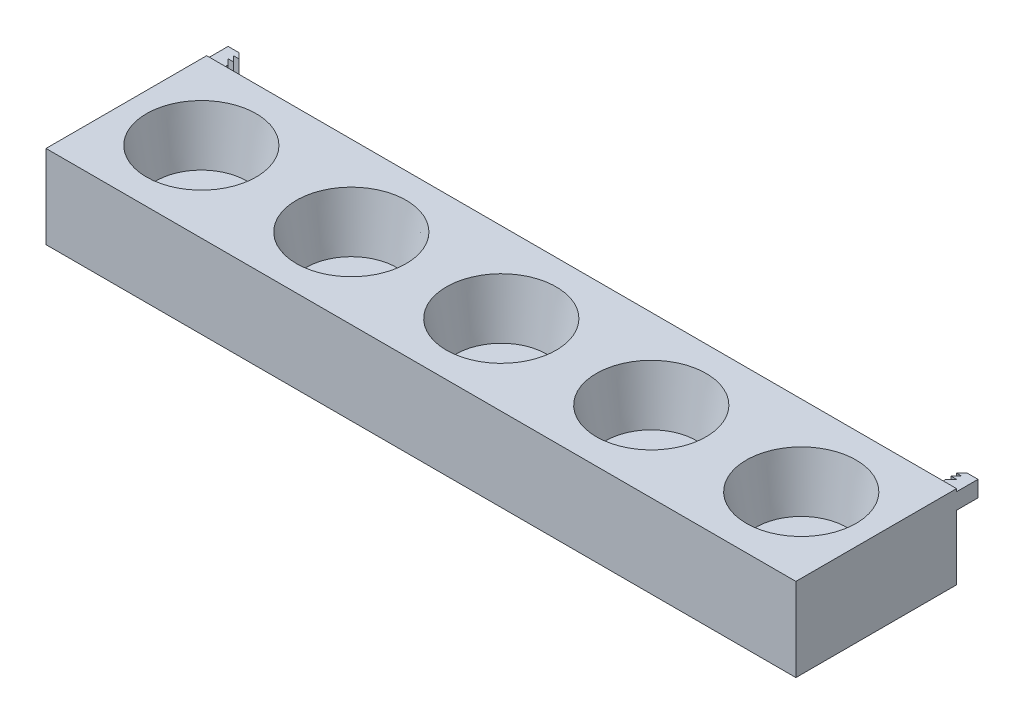
ISO-10303-21;
HEADER;
FILE_DESCRIPTION(('STEP AP214'),'2;1');
FILE_NAME('part.step','',(''),(''),'','','');
FILE_SCHEMA(('AUTOMOTIVE_DESIGN { 1 0 10303 214 1 1 1 1 }'));
ENDSEC;
DATA;
#1=APPLICATION_CONTEXT('core data for automotive mechanical design processes');
#2=APPLICATION_PROTOCOL_DEFINITION('international standard','automotive_design',2000,#1);
#3=PRODUCT_CONTEXT('',#1,'mechanical');
#4=PRODUCT('Part','Part','',(#3));
#5=PRODUCT_RELATED_PRODUCT_CATEGORY('part','',(#4));
#6=PRODUCT_DEFINITION_FORMATION('','',#4);
#7=PRODUCT_DEFINITION_CONTEXT('part definition',#1,'design');
#8=PRODUCT_DEFINITION('design','',#6,#7);
#9=PRODUCT_DEFINITION_SHAPE('','',#8);
#10=(LENGTH_UNIT() NAMED_UNIT(*) SI_UNIT(.MILLI.,.METRE.));
#11=(NAMED_UNIT(*) PLANE_ANGLE_UNIT() SI_UNIT($,.RADIAN.));
#12=(NAMED_UNIT(*) SI_UNIT($,.STERADIAN.) SOLID_ANGLE_UNIT());
#13=UNCERTAINTY_MEASURE_WITH_UNIT(LENGTH_MEASURE(1.E-05),#10,'distance_accuracy_value','');
#14=(GEOMETRIC_REPRESENTATION_CONTEXT(3) GLOBAL_UNCERTAINTY_ASSIGNED_CONTEXT((#13)) GLOBAL_UNIT_ASSIGNED_CONTEXT((#10,
#11,#12)) REPRESENTATION_CONTEXT('',''));
#15=CARTESIAN_POINT('',(0.,0.,0.));
#16=DIRECTION('',(0.,0.,1.));
#17=DIRECTION('',(1.,0.,0.));
#18=AXIS2_PLACEMENT_3D('',#15,#16,#17);
#19=CARTESIAN_POINT('',(-335.,17.5000000000234,-94.9999999999999));
#20=DIRECTION('',(-1.,0.,0.));
#21=DIRECTION('',(0.,0.,1.));
#22=AXIS2_PLACEMENT_3D('',#19,#20,#21);
#23=PLANE('',#22);
#24=DIRECTION('',(0.,0.,1.));
#25=VECTOR('',#24,1.);
#26=CARTESIAN_POINT('',(-335.,2.50000000000005,-94.9999999999999));
#27=LINE('',#26,#25);
#28=CARTESIAN_POINT('',(-335.,2.50000000002342,-80.0000000000001));
#29=VERTEX_POINT('',#28);
#30=CARTESIAN_POINT('',(-335.,2.50000000000005,-74.9999999999999));
#31=VERTEX_POINT('',#30);
#32=EDGE_CURVE('E234',#29,#31,#27,.T.);
#33=ORIENTED_EDGE('',*,*,#32,.F.);
#34=DIRECTION('',(0.,1.,0.));
#35=VECTOR('',#34,1.);
#36=CARTESIAN_POINT('',(-335.,2.50000000002342,-80.0000000000001));
#37=LINE('',#36,#35);
#38=CARTESIAN_POINT('',(-335.,17.5000000000234,-80.0000000000001));
#39=VERTEX_POINT('',#38);
#40=EDGE_CURVE('E224',#29,#39,#37,.T.);
#41=ORIENTED_EDGE('',*,*,#40,.T.);
#42=DIRECTION('',(0.,0.,1.));
#43=VECTOR('',#42,1.);
#44=CARTESIAN_POINT('',(-335.,17.5000000000234,-94.9999999999999));
#45=LINE('',#44,#43);
#46=CARTESIAN_POINT('',(-335.,17.5000000000234,-74.9999999999999));
#47=VERTEX_POINT('',#46);
#48=EDGE_CURVE('E93',#39,#47,#45,.T.);
#49=ORIENTED_EDGE('',*,*,#48,.T.);
#50=DIRECTION('',(0.,-1.,0.));
#51=VECTOR('',#50,1.);
#52=CARTESIAN_POINT('',(-335.,17.5000000000234,-74.9999999999999));
#53=LINE('',#52,#51);
#54=EDGE_CURVE('E358',#47,#31,#53,.T.);
#55=ORIENTED_EDGE('',*,*,#54,.T.);
#56=EDGE_LOOP('',(#33,#41,#49,#55));
#57=FACE_BOUND('',#56,.T.);
#58=ADVANCED_FACE('F68',(#57),#23,.F.);
#59=CARTESIAN_POINT('',(334.999999999977,2.50000000000005,-95.));
#60=DIRECTION('',(0.,1.,0.));
#61=DIRECTION('',(-1.,0.,0.));
#62=AXIS2_PLACEMENT_3D('',#59,#60,#61);
#63=PLANE('',#62);
#64=DIRECTION('',(1.,0.,0.));
#65=VECTOR('',#64,1.);
#66=CARTESIAN_POINT('',(0.,2.50000000002342,-85.));
#67=LINE('',#66,#65);
#68=CARTESIAN_POINT('',(334.999999999977,2.50000000002342,-85.));
#69=VERTEX_POINT('',#68);
#70=CARTESIAN_POINT('',(339.999999999977,2.50000000002342,-85.));
#71=VERTEX_POINT('',#70);
#72=EDGE_CURVE('E388',#69,#71,#67,.T.);
#73=ORIENTED_EDGE('',*,*,#72,.F.);
#74=DIRECTION('',(-0.707106781186548,0.,0.707106781186548));
#75=VECTOR('',#74,1.);
#76=CARTESIAN_POINT('',(124.999999999988,2.50000000002342,124.999999999988));
#77=LINE('',#76,#75);
#78=CARTESIAN_POINT('',(339.999999999977,2.50000000002342,-90.));
#79=VERTEX_POINT('',#78);
#80=EDGE_CURVE('E364',#79,#69,#77,.T.);
#81=ORIENTED_EDGE('',*,*,#80,.F.);
#82=DIRECTION('',(1.,0.,0.));
#83=VECTOR('',#82,1.);
#84=CARTESIAN_POINT('',(0.,2.50000000002342,-90.));
#85=LINE('',#84,#83);
#86=CARTESIAN_POINT('',(334.999999999977,2.50000000002342,-90.));
#87=VERTEX_POINT('',#86);
#88=EDGE_CURVE('E368',#87,#79,#85,.T.);
#89=ORIENTED_EDGE('',*,*,#88,.F.);
#90=DIRECTION('',(-0.707106781186547,0.,0.707106781186547));
#91=VECTOR('',#90,1.);
#92=CARTESIAN_POINT('',(339.999999999977,2.50000000002342,-95.));
#93=LINE('',#92,#91);
#94=CARTESIAN_POINT('',(339.999999999977,2.50000000002342,-95.));
#95=VERTEX_POINT('',#94);
#96=EDGE_CURVE('E372',#95,#87,#93,.T.);
#97=ORIENTED_EDGE('',*,*,#96,.F.);
#98=DIRECTION('',(-1.,0.,0.));
#99=VECTOR('',#98,1.);
#100=CARTESIAN_POINT('',(334.999999999977,2.50000000000005,-95.));
#101=LINE('',#100,#99);
#102=CARTESIAN_POINT('',(350.,2.50000000000005,-95.));
#103=VERTEX_POINT('',#102);
#104=EDGE_CURVE('E255',#103,#95,#101,.T.);
#105=ORIENTED_EDGE('',*,*,#104,.F.);
#106=DIRECTION('',(0.,0.,1.));
#107=VECTOR('',#106,1.);
#108=CARTESIAN_POINT('',(350.,2.50000000000005,-95.));
#109=LINE('',#108,#107);
#110=CARTESIAN_POINT('',(350.,2.50000000000005,-75.));
#111=VERTEX_POINT('',#110);
#112=EDGE_CURVE('E283',#103,#111,#109,.T.);
#113=ORIENTED_EDGE('',*,*,#112,.T.);
#114=DIRECTION('',(-1.,0.,0.));
#115=VECTOR('',#114,1.);
#116=CARTESIAN_POINT('',(334.999999999977,2.50000000000005,-75.));
#117=LINE('',#116,#115);
#118=CARTESIAN_POINT('',(334.999999999977,2.50000000000005,-75.));
#119=VERTEX_POINT('',#118);
#120=EDGE_CURVE('E251',#111,#119,#117,.T.);
#121=ORIENTED_EDGE('',*,*,#120,.T.);
#122=DIRECTION('',(0.,0.,1.));
#123=VECTOR('',#122,1.);
#124=CARTESIAN_POINT('',(334.999999999977,2.50000000000005,-95.));
#125=LINE('',#124,#123);
#126=CARTESIAN_POINT('',(334.999999999977,2.50000000002342,-80.));
#127=VERTEX_POINT('',#126);
#128=EDGE_CURVE('E278',#127,#119,#125,.T.);
#129=ORIENTED_EDGE('',*,*,#128,.F.);
#130=DIRECTION('',(-0.707106781186548,0.,0.707106781186548));
#131=VECTOR('',#130,1.);
#132=CARTESIAN_POINT('',(127.499999999988,2.50000000002342,127.499999999988));
#133=LINE('',#132,#131);
#134=EDGE_CURVE('E383',#71,#127,#133,.T.);
#135=ORIENTED_EDGE('',*,*,#134,.F.);
#136=EDGE_LOOP('',(#73,#81,#89,#97,#105,#113,#121,#129,#135));
#137=FACE_BOUND('',#136,.T.);
#138=ADVANCED_FACE('F490',(#137),#63,.F.);
#139=CARTESIAN_POINT('',(334.999999999977,17.5000000000234,-95.));
#140=DIRECTION('',(0.,-1.,0.));
#141=DIRECTION('',(0.,0.,-1.));
#142=AXIS2_PLACEMENT_3D('',#139,#140,#141);
#143=PLANE('',#142);
#144=DIRECTION('',(1.,0.,0.));
#145=VECTOR('',#144,1.);
#146=CARTESIAN_POINT('',(0.,17.5000000000234,-85.));
#147=LINE('',#146,#145);
#148=CARTESIAN_POINT('',(334.999999999977,17.5000000000234,-85.));
#149=VERTEX_POINT('',#148);
#150=CARTESIAN_POINT('',(339.999999999977,17.5000000000234,-85.));
#151=VERTEX_POINT('',#150);
#152=EDGE_CURVE('E85',#149,#151,#147,.T.);
#153=ORIENTED_EDGE('',*,*,#152,.T.);
#154=DIRECTION('',(-0.707106781186548,0.,0.707106781186548));
#155=VECTOR('',#154,1.);
#156=CARTESIAN_POINT('',(127.499999999988,17.5000000000234,127.499999999988));
#157=LINE('',#156,#155);
#158=CARTESIAN_POINT('',(334.999999999977,17.5000000000234,-80.));
#159=VERTEX_POINT('',#158);
#160=EDGE_CURVE('E391',#151,#159,#157,.T.);
#161=ORIENTED_EDGE('',*,*,#160,.T.);
#162=DIRECTION('',(0.,0.,1.));
#163=VECTOR('',#162,1.);
#164=CARTESIAN_POINT('',(334.999999999977,17.5000000000234,-95.));
#165=LINE('',#164,#163);
#166=CARTESIAN_POINT('',(334.999999999977,17.5000000000234,-75.));
#167=VERTEX_POINT('',#166);
#168=EDGE_CURVE('E267',#159,#167,#165,.T.);
#169=ORIENTED_EDGE('',*,*,#168,.T.);
#170=DIRECTION('',(1.,0.,0.));
#171=VECTOR('',#170,1.);
#172=CARTESIAN_POINT('',(334.999999999977,17.5000000000234,-75.));
#173=LINE('',#172,#171);
#174=CARTESIAN_POINT('',(350.,17.5000000000234,-75.));
#175=VERTEX_POINT('',#174);
#176=EDGE_CURVE('E256',#167,#175,#173,.T.);
#177=ORIENTED_EDGE('',*,*,#176,.T.);
#178=DIRECTION('',(0.,0.,1.));
#179=VECTOR('',#178,1.);
#180=CARTESIAN_POINT('',(350.,17.5000000000234,-95.));
#181=LINE('',#180,#179);
#182=CARTESIAN_POINT('',(350.,17.5000000000234,-95.));
#183=VERTEX_POINT('',#182);
#184=EDGE_CURVE('E261',#183,#175,#181,.T.);
#185=ORIENTED_EDGE('',*,*,#184,.F.);
#186=DIRECTION('',(1.,0.,0.));
#187=VECTOR('',#186,1.);
#188=CARTESIAN_POINT('',(334.999999999977,17.5000000000234,-95.));
#189=LINE('',#188,#187);
#190=CARTESIAN_POINT('',(339.999999999977,17.5000000000234,-95.));
#191=VERTEX_POINT('',#190);
#192=EDGE_CURVE('E259',#191,#183,#189,.T.);
#193=ORIENTED_EDGE('',*,*,#192,.F.);
#194=DIRECTION('',(-0.707106781186547,0.,0.707106781186547));
#195=VECTOR('',#194,1.);
#196=CARTESIAN_POINT('',(339.999999999977,17.5000000000234,-95.));
#197=LINE('',#196,#195);
#198=CARTESIAN_POINT('',(334.999999999977,17.5000000000234,-90.));
#199=VERTEX_POINT('',#198);
#200=EDGE_CURVE('E380',#191,#199,#197,.T.);
#201=ORIENTED_EDGE('',*,*,#200,.T.);
#202=DIRECTION('',(1.,0.,0.));
#203=VECTOR('',#202,1.);
#204=CARTESIAN_POINT('',(0.,17.5000000000234,-90.));
#205=LINE('',#204,#203);
#206=CARTESIAN_POINT('',(339.999999999977,17.5000000000234,-90.));
#207=VERTEX_POINT('',#206);
#208=EDGE_CURVE('E369',#199,#207,#205,.T.);
#209=ORIENTED_EDGE('',*,*,#208,.T.);
#210=DIRECTION('',(-0.707106781186548,0.,0.707106781186548));
#211=VECTOR('',#210,1.);
#212=CARTESIAN_POINT('',(124.999999999988,17.5000000000234,124.999999999988));
#213=LINE('',#212,#211);
#214=EDGE_CURVE('E365',#207,#149,#213,.T.);
#215=ORIENTED_EDGE('',*,*,#214,.T.);
#216=EDGE_LOOP('',(#153,#161,#169,#177,#185,#193,#201,#209,#215));
#217=FACE_BOUND('',#216,.T.);
#218=ADVANCED_FACE('F495',(#217),#143,.F.);
#219=CARTESIAN_POINT('',(334.999999999977,17.5000000000234,-95.));
#220=DIRECTION('',(1.,0.,0.));
#221=DIRECTION('',(0.,0.,-1.));
#222=AXIS2_PLACEMENT_3D('',#219,#220,#221);
#223=PLANE('',#222);
#224=DIRECTION('',(0.,1.,0.));
#225=VECTOR('',#224,1.);
#226=CARTESIAN_POINT('',(334.999999999977,2.50000000002342,-80.));
#227=LINE('',#226,#225);
#228=EDGE_CURVE('E386',#127,#159,#227,.T.);
#229=ORIENTED_EDGE('',*,*,#228,.F.);
#230=ORIENTED_EDGE('',*,*,#128,.T.);
#231=DIRECTION('',(0.,1.,0.));
#232=VECTOR('',#231,1.);
#233=CARTESIAN_POINT('',(334.999999999977,17.5000000000234,-75.));
#234=LINE('',#233,#232);
#235=EDGE_CURVE('E262',#119,#167,#234,.T.);
#236=ORIENTED_EDGE('',*,*,#235,.T.);
#237=ORIENTED_EDGE('',*,*,#168,.F.);
#238=EDGE_LOOP('',(#229,#230,#236,#237));
#239=FACE_BOUND('',#238,.T.);
#240=ADVANCED_FACE('F510',(#239),#223,.F.);
#241=CARTESIAN_POINT('',(0.,0.,-95.));
#242=DIRECTION('',(0.,0.,1.));
#243=DIRECTION('',(1.,0.,0.));
#244=AXIS2_PLACEMENT_3D('',#241,#242,#243);
#245=PLANE('',#244);
#246=DIRECTION('',(0.,1.,0.));
#247=VECTOR('',#246,1.);
#248=CARTESIAN_POINT('',(339.999999999977,2.50000000002342,-95.));
#249=LINE('',#248,#247);
#250=EDGE_CURVE('E376',#95,#191,#249,.T.);
#251=ORIENTED_EDGE('',*,*,#250,.T.);
#252=ORIENTED_EDGE('',*,*,#192,.T.);
#253=DIRECTION('',(0.,-1.,0.));
#254=VECTOR('',#253,1.);
#255=CARTESIAN_POINT('',(350.,17.5000000000234,-95.));
#256=LINE('',#255,#254);
#257=EDGE_CURVE('E252',#183,#103,#256,.T.);
#258=ORIENTED_EDGE('',*,*,#257,.T.);
#259=ORIENTED_EDGE('',*,*,#104,.T.);
#260=EDGE_LOOP('',(#251,#252,#258,#259));
#261=FACE_BOUND('',#260,.T.);
#262=ADVANCED_FACE('F507',(#261),#245,.F.);
#263=CARTESIAN_POINT('',(350.,-57.8,-75.));
#264=DIRECTION('',(0.,0.,-1.));
#265=DIRECTION('',(-1.,0.,0.));
#266=AXIS2_PLACEMENT_3D('',#263,#264,#265);
#267=PLANE('',#266);
#268=DIRECTION('',(0.,1.,0.));
#269=VECTOR('',#268,1.);
#270=CARTESIAN_POINT('',(-350.,-57.8,-74.9999999999999));
#271=LINE('',#270,#269);
#272=CARTESIAN_POINT('',(-350.,-57.8,-74.9999999999999));
#273=VERTEX_POINT('',#272);
#274=CARTESIAN_POINT('',(-350.000000000023,2.50000000000005,-74.9999999999999));
#275=VERTEX_POINT('',#274);
#276=EDGE_CURVE('E12',#273,#275,#271,.T.);
#277=ORIENTED_EDGE('',*,*,#276,.T.);
#278=DIRECTION('',(-1.,0.,0.));
#279=VECTOR('',#278,1.);
#280=CARTESIAN_POINT('',(-350.000000000023,2.50000000000005,-74.9999999999999));
#281=LINE('',#280,#279);
#282=EDGE_CURVE('E354',#31,#275,#281,.T.);
#283=ORIENTED_EDGE('',*,*,#282,.F.);
#284=ORIENTED_EDGE('',*,*,#54,.F.);
#285=DIRECTION('',(1.,0.,0.));
#286=VECTOR('',#285,1.);
#287=CARTESIAN_POINT('',(-350.000000000023,17.5000000000234,-74.9999999999999));
#288=LINE('',#287,#286);
#289=CARTESIAN_POINT('',(-350.000000000023,17.5000000000234,-74.9999999999999));
#290=VERTEX_POINT('',#289);
#291=EDGE_CURVE('E240',#290,#47,#288,.T.);
#292=ORIENTED_EDGE('',*,*,#291,.F.);
#293=CARTESIAN_POINT('',(-350.,20.,-74.9999999999999));
#294=VERTEX_POINT('',#293);
#295=EDGE_CURVE('E77',#290,#294,#271,.T.);
#296=ORIENTED_EDGE('',*,*,#295,.T.);
#297=DIRECTION('',(-1.,0.,0.));
#298=VECTOR('',#297,1.);
#299=CARTESIAN_POINT('',(350.,20.,-75.));
#300=LINE('',#299,#298);
#301=CARTESIAN_POINT('',(350.,20.,-75.));
#302=VERTEX_POINT('',#301);
#303=EDGE_CURVE('E299',#302,#294,#300,.T.);
#304=ORIENTED_EDGE('',*,*,#303,.F.);
#305=DIRECTION('',(0.,1.,0.));
#306=VECTOR('',#305,1.);
#307=CARTESIAN_POINT('',(350.,-57.8,-75.));
#308=LINE('',#307,#306);
#309=EDGE_CURVE('E321',#175,#302,#308,.T.);
#310=ORIENTED_EDGE('',*,*,#309,.F.);
#311=ORIENTED_EDGE('',*,*,#176,.F.);
#312=ORIENTED_EDGE('',*,*,#235,.F.);
#313=ORIENTED_EDGE('',*,*,#120,.F.);
#314=CARTESIAN_POINT('',(350.,-57.8,-75.));
#315=VERTEX_POINT('',#314);
#316=EDGE_CURVE('E324',#315,#111,#308,.T.);
#317=ORIENTED_EDGE('',*,*,#316,.F.);
#318=DIRECTION('',(-1.,0.,0.));
#319=VECTOR('',#318,1.);
#320=CARTESIAN_POINT('',(350.,-57.8,-75.));
#321=LINE('',#320,#319);
#322=EDGE_CURVE('E311',#315,#273,#321,.T.);
#323=ORIENTED_EDGE('',*,*,#322,.T.);
#324=EDGE_LOOP('',(#277,#283,#284,#292,#296,#304,#310,#311,#312,#313,#317,#323));
#325=FACE_BOUND('',#324,.T.);
#326=ADVANCED_FACE('F336',(#325),#267,.T.);
#327=CARTESIAN_POINT('',(-350.,-57.8,-74.9999999999999));
#328=DIRECTION('',(-1.,0.,0.));
#329=DIRECTION('',(0.,0.,1.));
#330=AXIS2_PLACEMENT_3D('',#327,#328,#329);
#331=PLANE('',#330);
#332=DIRECTION('',(0.,1.,0.));
#333=VECTOR('',#332,1.);
#334=CARTESIAN_POINT('',(-350.,-57.8,75.0000000000001));
#335=LINE('',#334,#333);
#336=CARTESIAN_POINT('',(-350.,-57.8,75.0000000000001));
#337=VERTEX_POINT('',#336);
#338=CARTESIAN_POINT('',(-350.,20.,75.0000000000001));
#339=VERTEX_POINT('',#338);
#340=EDGE_CURVE('E313',#337,#339,#335,.T.);
#341=ORIENTED_EDGE('',*,*,#340,.T.);
#342=DIRECTION('',(0.,0.,1.));
#343=VECTOR('',#342,1.);
#344=CARTESIAN_POINT('',(-350.,20.,-74.9999999999999));
#345=LINE('',#344,#343);
#346=EDGE_CURVE('E289',#294,#339,#345,.T.);
#347=ORIENTED_EDGE('',*,*,#346,.F.);
#348=ORIENTED_EDGE('',*,*,#295,.F.);
#349=DIRECTION('',(0.,0.,1.));
#350=VECTOR('',#349,1.);
#351=CARTESIAN_POINT('',(-350.000000000023,17.5000000000234,-94.9999999999999));
#352=LINE('',#351,#350);
#353=CARTESIAN_POINT('',(-350.000000000023,17.5000000000234,-94.9999999999999));
#354=VERTEX_POINT('',#353);
#355=EDGE_CURVE('E242',#354,#290,#352,.T.);
#356=ORIENTED_EDGE('',*,*,#355,.F.);
#357=DIRECTION('',(0.,1.,0.));
#358=VECTOR('',#357,1.);
#359=CARTESIAN_POINT('',(-350.000000000023,17.5000000000234,-94.9999999999999));
#360=LINE('',#359,#358);
#361=CARTESIAN_POINT('',(-350.000000000023,2.50000000000005,-94.9999999999999));
#362=VERTEX_POINT('',#361);
#363=EDGE_CURVE('E341',#362,#354,#360,.T.);
#364=ORIENTED_EDGE('',*,*,#363,.F.);
#365=DIRECTION('',(0.,0.,1.));
#366=VECTOR('',#365,1.);
#367=CARTESIAN_POINT('',(-350.000000000023,2.50000000000005,-94.9999999999999));
#368=LINE('',#367,#366);
#369=EDGE_CURVE('E244',#362,#275,#368,.T.);
#370=ORIENTED_EDGE('',*,*,#369,.T.);
#371=ORIENTED_EDGE('',*,*,#276,.F.);
#372=DIRECTION('',(0.,0.,1.));
#373=VECTOR('',#372,1.);
#374=CARTESIAN_POINT('',(-350.,-57.8,-74.9999999999999));
#375=LINE('',#374,#373);
#376=EDGE_CURVE('E302',#273,#337,#375,.T.);
#377=ORIENTED_EDGE('',*,*,#376,.T.);
#378=EDGE_LOOP('',(#341,#347,#348,#356,#364,#370,#371,#377));
#379=FACE_BOUND('',#378,.T.);
#380=ADVANCED_FACE('F70',(#379),#331,.T.);
#381=CARTESIAN_POINT('',(350.,-57.8,-75.));
#382=DIRECTION('',(1.,0.,0.));
#383=DIRECTION('',(0.,0.,-1.));
#384=AXIS2_PLACEMENT_3D('',#381,#382,#383);
#385=PLANE('',#384);
#386=ORIENTED_EDGE('',*,*,#316,.T.);
#387=ORIENTED_EDGE('',*,*,#112,.F.);
#388=ORIENTED_EDGE('',*,*,#257,.F.);
#389=ORIENTED_EDGE('',*,*,#184,.T.);
#390=ORIENTED_EDGE('',*,*,#309,.T.);
#391=DIRECTION('',(0.,0.,-1.));
#392=VECTOR('',#391,1.);
#393=CARTESIAN_POINT('',(350.,20.,-75.));
#394=LINE('',#393,#392);
#395=CARTESIAN_POINT('',(350.,20.,75.));
#396=VERTEX_POINT('',#395);
#397=EDGE_CURVE('E296',#396,#302,#394,.T.);
#398=ORIENTED_EDGE('',*,*,#397,.F.);
#399=DIRECTION('',(0.,1.,0.));
#400=VECTOR('',#399,1.);
#401=CARTESIAN_POINT('',(350.,-57.8,75.));
#402=LINE('',#401,#400);
#403=CARTESIAN_POINT('',(350.,-57.8,75.));
#404=VERTEX_POINT('',#403);
#405=EDGE_CURVE('E317',#404,#396,#402,.T.);
#406=ORIENTED_EDGE('',*,*,#405,.F.);
#407=DIRECTION('',(0.,0.,-1.));
#408=VECTOR('',#407,1.);
#409=CARTESIAN_POINT('',(350.,-57.8,-75.));
#410=LINE('',#409,#408);
#411=EDGE_CURVE('E308',#404,#315,#410,.T.);
#412=ORIENTED_EDGE('',*,*,#411,.T.);
#413=EDGE_LOOP('',(#386,#387,#388,#389,#390,#398,#406,#412));
#414=FACE_BOUND('',#413,.T.);
#415=ADVANCED_FACE('F331',(#414),#385,.T.);
#416=CARTESIAN_POINT('',(350.,-57.8,75.));
#417=DIRECTION('',(0.,0.,1.));
#418=DIRECTION('',(1.,0.,0.));
#419=AXIS2_PLACEMENT_3D('',#416,#417,#418);
#420=PLANE('',#419);
#421=ORIENTED_EDGE('',*,*,#405,.T.);
#422=DIRECTION('',(1.,0.,0.));
#423=VECTOR('',#422,1.);
#424=CARTESIAN_POINT('',(350.,20.,75.));
#425=LINE('',#424,#423);
#426=EDGE_CURVE('E293',#339,#396,#425,.T.);
#427=ORIENTED_EDGE('',*,*,#426,.F.);
#428=ORIENTED_EDGE('',*,*,#340,.F.);
#429=DIRECTION('',(1.,0.,0.));
#430=VECTOR('',#429,1.);
#431=CARTESIAN_POINT('',(350.,-57.8,75.));
#432=LINE('',#431,#430);
#433=EDGE_CURVE('E305',#337,#404,#432,.T.);
#434=ORIENTED_EDGE('',*,*,#433,.T.);
#435=EDGE_LOOP('',(#421,#427,#428,#434));
#436=FACE_BOUND('',#435,.T.);
#437=ADVANCED_FACE('F518',(#436),#420,.T.);
#438=CARTESIAN_POINT('',(0.,-57.8,0.));
#439=DIRECTION('',(0.,-1.,0.));
#440=DIRECTION('',(0.,0.,-1.));
#441=AXIS2_PLACEMENT_3D('',#438,#439,#440);
#442=PLANE('',#441);
#443=ORIENTED_EDGE('',*,*,#376,.F.);
#444=ORIENTED_EDGE('',*,*,#322,.F.);
#445=ORIENTED_EDGE('',*,*,#411,.F.);
#446=ORIENTED_EDGE('',*,*,#433,.F.);
#447=EDGE_LOOP('',(#443,#444,#445,#446));
#448=FACE_BOUND('',#447,.T.);
#449=ADVANCED_FACE('F463',(#448),#442,.T.);
#450=CARTESIAN_POINT('',(0.,20.,0.));
#451=DIRECTION('',(0.,-1.,0.));
#452=DIRECTION('',(0.,0.,-1.));
#453=AXIS2_PLACEMENT_3D('',#450,#451,#452);
#454=PLANE('',#453);
#455=CARTESIAN_POINT('',(-280.,20.,0.));
#456=DIRECTION('',(0.,1.,0.));
#457=DIRECTION('',(0.,0.,1.));
#458=AXIS2_PLACEMENT_3D('',#455,#456,#457);
#459=CIRCLE('',#458,51.25);
#460=CARTESIAN_POINT('',(-280.,20.,51.25));
#461=VERTEX_POINT('',#460);
#462=EDGE_CURVE('E454',#461,#461,#459,.T.);
#463=ORIENTED_EDGE('',*,*,#462,.F.);
#464=EDGE_LOOP('',(#463));
#465=FACE_BOUND('',#464,.T.);
#466=CARTESIAN_POINT('',(-140.,20.,0.));
#467=DIRECTION('',(0.,1.,0.));
#468=DIRECTION('',(0.,0.,1.));
#469=AXIS2_PLACEMENT_3D('',#466,#467,#468);
#470=CIRCLE('',#469,51.25);
#471=CARTESIAN_POINT('',(-140.,20.,51.25));
#472=VERTEX_POINT('',#471);
#473=EDGE_CURVE('E448',#472,#472,#470,.T.);
#474=ORIENTED_EDGE('',*,*,#473,.F.);
#475=EDGE_LOOP('',(#474));
#476=FACE_BOUND('',#475,.T.);
#477=CARTESIAN_POINT('',(280.,20.,0.));
#478=DIRECTION('',(0.,1.,0.));
#479=DIRECTION('',(0.,0.,1.));
#480=AXIS2_PLACEMENT_3D('',#477,#478,#479);
#481=CIRCLE('',#480,51.25);
#482=CARTESIAN_POINT('',(280.,20.,51.25));
#483=VERTEX_POINT('',#482);
#484=EDGE_CURVE('E442',#483,#483,#481,.T.);
#485=ORIENTED_EDGE('',*,*,#484,.F.);
#486=EDGE_LOOP('',(#485));
#487=FACE_BOUND('',#486,.T.);
#488=CARTESIAN_POINT('',(140.,20.,0.));
#489=DIRECTION('',(0.,1.,0.));
#490=DIRECTION('',(0.,0.,1.));
#491=AXIS2_PLACEMENT_3D('',#488,#489,#490);
#492=CIRCLE('',#491,51.25);
#493=CARTESIAN_POINT('',(140.,20.,51.25));
#494=VERTEX_POINT('',#493);
#495=EDGE_CURVE('E436',#494,#494,#492,.T.);
#496=ORIENTED_EDGE('',*,*,#495,.F.);
#497=EDGE_LOOP('',(#496));
#498=FACE_BOUND('',#497,.T.);
#499=CARTESIAN_POINT('',(0.,20.,0.));
#500=DIRECTION('',(0.,1.,0.));
#501=DIRECTION('',(0.,0.,1.));
#502=AXIS2_PLACEMENT_3D('',#499,#500,#501);
#503=CIRCLE('',#502,51.25);
#504=CARTESIAN_POINT('',(0.,20.,51.25));
#505=VERTEX_POINT('',#504);
#506=EDGE_CURVE('E430',#505,#505,#503,.T.);
#507=ORIENTED_EDGE('',*,*,#506,.F.);
#508=EDGE_LOOP('',(#507));
#509=FACE_BOUND('',#508,.T.);
#510=ORIENTED_EDGE('',*,*,#346,.T.);
#511=ORIENTED_EDGE('',*,*,#426,.T.);
#512=ORIENTED_EDGE('',*,*,#397,.T.);
#513=ORIENTED_EDGE('',*,*,#303,.T.);
#514=EDGE_LOOP('',(#510,#511,#512,#513));
#515=FACE_BOUND('',#514,.T.);
#516=ADVANCED_FACE('F335',(#465,#476,#487,#498,#509,#515),#454,.F.);
#517=CARTESIAN_POINT('',(-350.000000000023,2.50000000000005,-94.9999999999999));
#518=DIRECTION('',(0.,1.,0.));
#519=DIRECTION('',(-1.,0.,0.));
#520=AXIS2_PLACEMENT_3D('',#517,#518,#519);
#521=PLANE('',#520);
#522=DIRECTION('',(-1.,0.,0.));
#523=VECTOR('',#522,1.);
#524=CARTESIAN_POINT('',(0.,2.50000000002342,-85.));
#525=LINE('',#524,#523);
#526=CARTESIAN_POINT('',(-335.,2.50000000002342,-85.0000000000001));
#527=VERTEX_POINT('',#526);
#528=CARTESIAN_POINT('',(-340.,2.50000000002342,-84.9999999999999));
#529=VERTEX_POINT('',#528);
#530=EDGE_CURVE('E235',#527,#529,#525,.T.);
#531=ORIENTED_EDGE('',*,*,#530,.T.);
#532=DIRECTION('',(0.707106781186548,0.,0.707106781186548));
#533=VECTOR('',#532,1.);
#534=CARTESIAN_POINT('',(-127.5,2.50000000002342,127.5));
#535=LINE('',#534,#533);
#536=EDGE_CURVE('E236',#529,#29,#535,.T.);
#537=ORIENTED_EDGE('',*,*,#536,.T.);
#538=ORIENTED_EDGE('',*,*,#32,.T.);
#539=ORIENTED_EDGE('',*,*,#282,.T.);
#540=ORIENTED_EDGE('',*,*,#369,.F.);
#541=DIRECTION('',(-1.,0.,0.));
#542=VECTOR('',#541,1.);
#543=CARTESIAN_POINT('',(-350.000000000023,2.50000000000005,-94.9999999999999));
#544=LINE('',#543,#542);
#545=CARTESIAN_POINT('',(-340.,2.50000000002342,-94.9999999999999));
#546=VERTEX_POINT('',#545);
#547=EDGE_CURVE('E350',#546,#362,#544,.T.);
#548=ORIENTED_EDGE('',*,*,#547,.F.);
#549=DIRECTION('',(0.707106781186548,0.,0.707106781186548));
#550=VECTOR('',#549,1.);
#551=CARTESIAN_POINT('',(-122.5,2.50000000002342,122.5));
#552=LINE('',#551,#550);
#553=CARTESIAN_POINT('',(-335.,2.50000000002342,-89.9999999999999));
#554=VERTEX_POINT('',#553);
#555=EDGE_CURVE('E417',#546,#554,#552,.T.);
#556=ORIENTED_EDGE('',*,*,#555,.T.);
#557=DIRECTION('',(-1.,0.,0.));
#558=VECTOR('',#557,1.);
#559=CARTESIAN_POINT('',(0.,2.50000000002342,-89.9999999999999));
#560=LINE('',#559,#558);
#561=CARTESIAN_POINT('',(-340.,2.50000000002342,-89.9999999999999));
#562=VERTEX_POINT('',#561);
#563=EDGE_CURVE('E409',#554,#562,#560,.T.);
#564=ORIENTED_EDGE('',*,*,#563,.T.);
#565=DIRECTION('',(0.707106781186548,0.,0.707106781186548));
#566=VECTOR('',#565,1.);
#567=CARTESIAN_POINT('',(-125.,2.50000000002342,125.));
#568=LINE('',#567,#566);
#569=EDGE_CURVE('E403',#562,#527,#568,.T.);
#570=ORIENTED_EDGE('',*,*,#569,.T.);
#571=EDGE_LOOP('',(#531,#537,#538,#539,#540,#548,#556,#564,#570));
#572=FACE_BOUND('',#571,.T.);
#573=ADVANCED_FACE('F462',(#572),#521,.F.);
#574=CARTESIAN_POINT('',(-350.000000000023,17.5000000000234,-94.9999999999999));
#575=DIRECTION('',(0.,-1.,0.));
#576=DIRECTION('',(0.,0.,-1.));
#577=AXIS2_PLACEMENT_3D('',#574,#575,#576);
#578=PLANE('',#577);
#579=ORIENTED_EDGE('',*,*,#48,.F.);
#580=DIRECTION('',(0.707106781186548,0.,0.707106781186548));
#581=VECTOR('',#580,1.);
#582=CARTESIAN_POINT('',(-127.5,17.5000000000234,127.5));
#583=LINE('',#582,#581);
#584=CARTESIAN_POINT('',(-340.,17.5000000000234,-84.9999999999999));
#585=VERTEX_POINT('',#584);
#586=EDGE_CURVE('E221',#585,#39,#583,.T.);
#587=ORIENTED_EDGE('',*,*,#586,.F.);
#588=DIRECTION('',(-1.,0.,0.));
#589=VECTOR('',#588,1.);
#590=CARTESIAN_POINT('',(0.,17.5000000000234,-85.));
#591=LINE('',#590,#589);
#592=CARTESIAN_POINT('',(-335.,17.5000000000234,-85.0000000000001));
#593=VERTEX_POINT('',#592);
#594=EDGE_CURVE('E231',#593,#585,#591,.T.);
#595=ORIENTED_EDGE('',*,*,#594,.F.);
#596=DIRECTION('',(0.707106781186548,0.,0.707106781186548));
#597=VECTOR('',#596,1.);
#598=CARTESIAN_POINT('',(-125.,17.5000000000234,125.));
#599=LINE('',#598,#597);
#600=CARTESIAN_POINT('',(-340.,17.5000000000234,-89.9999999999999));
#601=VERTEX_POINT('',#600);
#602=EDGE_CURVE('E406',#601,#593,#599,.T.);
#603=ORIENTED_EDGE('',*,*,#602,.F.);
#604=DIRECTION('',(-1.,0.,0.));
#605=VECTOR('',#604,1.);
#606=CARTESIAN_POINT('',(0.,17.5000000000234,-89.9999999999999));
#607=LINE('',#606,#605);
#608=CARTESIAN_POINT('',(-335.,17.5000000000234,-89.9999999999999));
#609=VERTEX_POINT('',#608);
#610=EDGE_CURVE('E410',#609,#601,#607,.T.);
#611=ORIENTED_EDGE('',*,*,#610,.F.);
#612=DIRECTION('',(0.707106781186548,0.,0.707106781186548));
#613=VECTOR('',#612,1.);
#614=CARTESIAN_POINT('',(-122.5,17.5000000000234,122.5));
#615=LINE('',#614,#613);
#616=CARTESIAN_POINT('',(-340.,17.5000000000234,-94.9999999999999));
#617=VERTEX_POINT('',#616);
#618=EDGE_CURVE('E346',#617,#609,#615,.T.);
#619=ORIENTED_EDGE('',*,*,#618,.F.);
#620=DIRECTION('',(1.,0.,0.));
#621=VECTOR('',#620,1.);
#622=CARTESIAN_POINT('',(-350.000000000023,17.5000000000234,-94.9999999999999));
#623=LINE('',#622,#621);
#624=EDGE_CURVE('E246',#354,#617,#623,.T.);
#625=ORIENTED_EDGE('',*,*,#624,.F.);
#626=ORIENTED_EDGE('',*,*,#355,.T.);
#627=ORIENTED_EDGE('',*,*,#291,.T.);
#628=EDGE_LOOP('',(#579,#587,#595,#603,#611,#619,#625,#626,#627));
#629=FACE_BOUND('',#628,.T.);
#630=ADVANCED_FACE('F238',(#629),#578,.F.);
#631=CARTESIAN_POINT('',(0.,0.,-94.9999999999999));
#632=DIRECTION('',(0.,0.,-1.));
#633=DIRECTION('',(-1.,0.,0.));
#634=AXIS2_PLACEMENT_3D('',#631,#632,#633);
#635=PLANE('',#634);
#636=DIRECTION('',(0.,1.,0.));
#637=VECTOR('',#636,1.);
#638=CARTESIAN_POINT('',(-340.,2.50000000002342,-94.9999999999999));
#639=LINE('',#638,#637);
#640=EDGE_CURVE('E230',#546,#617,#639,.T.);
#641=ORIENTED_EDGE('',*,*,#640,.F.);
#642=ORIENTED_EDGE('',*,*,#547,.T.);
#643=ORIENTED_EDGE('',*,*,#363,.T.);
#644=ORIENTED_EDGE('',*,*,#624,.T.);
#645=EDGE_LOOP('',(#641,#642,#643,#644));
#646=FACE_BOUND('',#645,.T.);
#647=ADVANCED_FACE('F500',(#646),#635,.T.);
#648=CARTESIAN_POINT('',(0.,2.50000000002342,-90.));
#649=DIRECTION('',(0.,0.,1.));
#650=DIRECTION('',(1.,0.,0.));
#651=AXIS2_PLACEMENT_3D('',#648,#649,#650);
#652=PLANE('',#651);
#653=ORIENTED_EDGE('',*,*,#208,.F.);
#654=DIRECTION('',(0.,1.,0.));
#655=VECTOR('',#654,1.);
#656=CARTESIAN_POINT('',(334.999999999977,2.50000000002342,-90.));
#657=LINE('',#656,#655);
#658=EDGE_CURVE('E379',#87,#199,#657,.T.);
#659=ORIENTED_EDGE('',*,*,#658,.F.);
#660=ORIENTED_EDGE('',*,*,#88,.T.);
#661=DIRECTION('',(0.,1.,0.));
#662=VECTOR('',#661,1.);
#663=CARTESIAN_POINT('',(339.999999999977,2.50000000002342,-90.));
#664=LINE('',#663,#662);
#665=EDGE_CURVE('E357',#79,#207,#664,.T.);
#666=ORIENTED_EDGE('',*,*,#665,.T.);
#667=EDGE_LOOP('',(#653,#659,#660,#666));
#668=FACE_BOUND('',#667,.T.);
#669=ADVANCED_FACE('F554',(#668),#652,.T.);
#670=CARTESIAN_POINT('',(124.999999999988,2.50000000002342,124.999999999988));
#671=DIRECTION('',(-0.707106781186547,0.,-0.707106781186547));
#672=DIRECTION('',(-0.707106781186548,0.,0.707106781186548));
#673=AXIS2_PLACEMENT_3D('',#670,#671,#672);
#674=PLANE('',#673);
#675=ORIENTED_EDGE('',*,*,#214,.F.);
#676=ORIENTED_EDGE('',*,*,#665,.F.);
#677=ORIENTED_EDGE('',*,*,#80,.T.);
#678=DIRECTION('',(0.,1.,0.));
#679=VECTOR('',#678,1.);
#680=CARTESIAN_POINT('',(334.999999999977,2.50000000002342,-85.));
#681=LINE('',#680,#679);
#682=EDGE_CURVE('E393',#69,#149,#681,.T.);
#683=ORIENTED_EDGE('',*,*,#682,.T.);
#684=EDGE_LOOP('',(#675,#676,#677,#683));
#685=FACE_BOUND('',#684,.T.);
#686=ADVANCED_FACE('F555',(#685),#674,.T.);
#687=CARTESIAN_POINT('',(339.999999999977,2.50000000002342,-95.));
#688=DIRECTION('',(-0.707106781186547,0.,-0.707106781186547));
#689=DIRECTION('',(-0.707106781186548,0.,0.707106781186548));
#690=AXIS2_PLACEMENT_3D('',#687,#688,#689);
#691=PLANE('',#690);
#692=ORIENTED_EDGE('',*,*,#200,.F.);
#693=ORIENTED_EDGE('',*,*,#250,.F.);
#694=ORIENTED_EDGE('',*,*,#96,.T.);
#695=ORIENTED_EDGE('',*,*,#658,.T.);
#696=EDGE_LOOP('',(#692,#693,#694,#695));
#697=FACE_BOUND('',#696,.T.);
#698=ADVANCED_FACE('F563',(#697),#691,.T.);
#699=CARTESIAN_POINT('',(0.,2.50000000002342,-85.));
#700=DIRECTION('',(0.,0.,1.));
#701=DIRECTION('',(1.,0.,0.));
#702=AXIS2_PLACEMENT_3D('',#699,#700,#701);
#703=PLANE('',#702);
#704=ORIENTED_EDGE('',*,*,#152,.F.);
#705=ORIENTED_EDGE('',*,*,#682,.F.);
#706=ORIENTED_EDGE('',*,*,#72,.T.);
#707=DIRECTION('',(0.,1.,0.));
#708=VECTOR('',#707,1.);
#709=CARTESIAN_POINT('',(339.999999999977,2.50000000002342,-85.));
#710=LINE('',#709,#708);
#711=EDGE_CURVE('E389',#71,#151,#710,.T.);
#712=ORIENTED_EDGE('',*,*,#711,.T.);
#713=EDGE_LOOP('',(#704,#705,#706,#712));
#714=FACE_BOUND('',#713,.T.);
#715=ADVANCED_FACE('F577',(#714),#703,.T.);
#716=CARTESIAN_POINT('',(127.499999999988,2.50000000002342,127.499999999988));
#717=DIRECTION('',(-0.707106781186547,0.,-0.707106781186547));
#718=DIRECTION('',(-0.707106781186548,0.,0.707106781186548));
#719=AXIS2_PLACEMENT_3D('',#716,#717,#718);
#720=PLANE('',#719);
#721=ORIENTED_EDGE('',*,*,#160,.F.);
#722=ORIENTED_EDGE('',*,*,#711,.F.);
#723=ORIENTED_EDGE('',*,*,#134,.T.);
#724=ORIENTED_EDGE('',*,*,#228,.T.);
#725=EDGE_LOOP('',(#721,#722,#723,#724));
#726=FACE_BOUND('',#725,.T.);
#727=ADVANCED_FACE('F585',(#726),#720,.T.);
#728=CARTESIAN_POINT('',(-125.,2.50000000002342,125.));
#729=DIRECTION('',(-0.707106781186547,0.,0.707106781186547));
#730=DIRECTION('',(0.707106781186548,0.,0.707106781186548));
#731=AXIS2_PLACEMENT_3D('',#728,#729,#730);
#732=PLANE('',#731);
#733=ORIENTED_EDGE('',*,*,#602,.T.);
#734=DIRECTION('',(0.,1.,0.));
#735=VECTOR('',#734,1.);
#736=CARTESIAN_POINT('',(-335.,2.50000000002342,-85.0000000000001));
#737=LINE('',#736,#735);
#738=EDGE_CURVE('E395',#527,#593,#737,.T.);
#739=ORIENTED_EDGE('',*,*,#738,.F.);
#740=ORIENTED_EDGE('',*,*,#569,.F.);
#741=DIRECTION('',(0.,1.,0.));
#742=VECTOR('',#741,1.);
#743=CARTESIAN_POINT('',(-340.,2.50000000002342,-89.9999999999999));
#744=LINE('',#743,#742);
#745=EDGE_CURVE('E402',#562,#601,#744,.T.);
#746=ORIENTED_EDGE('',*,*,#745,.T.);
#747=EDGE_LOOP('',(#733,#739,#740,#746));
#748=FACE_BOUND('',#747,.T.);
#749=ADVANCED_FACE('F592',(#748),#732,.F.);
#750=CARTESIAN_POINT('',(0.,2.50000000002342,-89.9999999999999));
#751=DIRECTION('',(0.,0.,-1.));
#752=DIRECTION('',(-1.,0.,0.));
#753=AXIS2_PLACEMENT_3D('',#750,#751,#752);
#754=PLANE('',#753);
#755=ORIENTED_EDGE('',*,*,#610,.T.);
#756=ORIENTED_EDGE('',*,*,#745,.F.);
#757=ORIENTED_EDGE('',*,*,#563,.F.);
#758=DIRECTION('',(0.,1.,0.));
#759=VECTOR('',#758,1.);
#760=CARTESIAN_POINT('',(-335.,2.50000000002342,-89.9999999999999));
#761=LINE('',#760,#759);
#762=EDGE_CURVE('E399',#554,#609,#761,.T.);
#763=ORIENTED_EDGE('',*,*,#762,.T.);
#764=EDGE_LOOP('',(#755,#756,#757,#763));
#765=FACE_BOUND('',#764,.T.);
#766=ADVANCED_FACE('F599',(#765),#754,.F.);
#767=CARTESIAN_POINT('',(-122.5,2.50000000002342,122.5));
#768=DIRECTION('',(-0.707106781186547,0.,0.707106781186547));
#769=DIRECTION('',(0.707106781186548,0.,0.707106781186548));
#770=AXIS2_PLACEMENT_3D('',#767,#768,#769);
#771=PLANE('',#770);
#772=ORIENTED_EDGE('',*,*,#618,.T.);
#773=ORIENTED_EDGE('',*,*,#762,.F.);
#774=ORIENTED_EDGE('',*,*,#555,.F.);
#775=ORIENTED_EDGE('',*,*,#640,.T.);
#776=EDGE_LOOP('',(#772,#773,#774,#775));
#777=FACE_BOUND('',#776,.T.);
#778=ADVANCED_FACE('F607',(#777),#771,.F.);
#779=CARTESIAN_POINT('',(-127.5,2.50000000002342,127.5));
#780=DIRECTION('',(-0.707106781186547,0.,0.707106781186547));
#781=DIRECTION('',(0.707106781186548,0.,0.707106781186548));
#782=AXIS2_PLACEMENT_3D('',#779,#780,#781);
#783=PLANE('',#782);
#784=ORIENTED_EDGE('',*,*,#586,.T.);
#785=ORIENTED_EDGE('',*,*,#40,.F.);
#786=ORIENTED_EDGE('',*,*,#536,.F.);
#787=DIRECTION('',(0.,1.,0.));
#788=VECTOR('',#787,1.);
#789=CARTESIAN_POINT('',(-340.,2.50000000002342,-84.9999999999999));
#790=LINE('',#789,#788);
#791=EDGE_CURVE('E226',#529,#585,#790,.T.);
#792=ORIENTED_EDGE('',*,*,#791,.T.);
#793=EDGE_LOOP('',(#784,#785,#786,#792));
#794=FACE_BOUND('',#793,.T.);
#795=ADVANCED_FACE('F222',(#794),#783,.F.);
#796=CARTESIAN_POINT('',(0.,2.50000000002342,-85.));
#797=DIRECTION('',(0.,0.,-1.));
#798=DIRECTION('',(-1.,0.,0.));
#799=AXIS2_PLACEMENT_3D('',#796,#797,#798);
#800=PLANE('',#799);
#801=ORIENTED_EDGE('',*,*,#594,.T.);
#802=ORIENTED_EDGE('',*,*,#791,.F.);
#803=ORIENTED_EDGE('',*,*,#530,.F.);
#804=ORIENTED_EDGE('',*,*,#738,.T.);
#805=EDGE_LOOP('',(#801,#802,#803,#804));
#806=FACE_BOUND('',#805,.T.);
#807=ADVANCED_FACE('F476',(#806),#800,.F.);
#808=CARTESIAN_POINT('',(0.,20.,0.));
#809=DIRECTION('',(0.,1.,0.));
#810=DIRECTION('',(0.,0.,1.));
#811=AXIS2_PLACEMENT_3D('',#808,#809,#810);
#812=CONICAL_SURFACE('',#811,51.25,0.174532925199433);
#813=CARTESIAN_POINT('',(0.,-30.,0.));
#814=DIRECTION('',(0.,1.,0.));
#815=DIRECTION('',(0.,0.,1.));
#816=AXIS2_PLACEMENT_3D('',#813,#814,#815);
#817=CIRCLE('',#816,42.4336509645768);
#818=CARTESIAN_POINT('',(0.,-30.,42.4336509645768));
#819=VERTEX_POINT('',#818);
#820=EDGE_CURVE('E425',#819,#819,#817,.T.);
#821=ORIENTED_EDGE('',*,*,#820,.F.);
#822=EDGE_LOOP('',(#821));
#823=FACE_BOUND('',#822,.T.);
#824=ORIENTED_EDGE('',*,*,#506,.T.);
#825=EDGE_LOOP('',(#824));
#826=FACE_BOUND('',#825,.T.);
#827=ADVANCED_FACE('F473',(#823,#826),#812,.F.);
#828=CARTESIAN_POINT('',(0.,-30.,0.));
#829=DIRECTION('',(0.,1.,0.));
#830=DIRECTION('',(0.,0.,1.));
#831=AXIS2_PLACEMENT_3D('',#828,#829,#830);
#832=PLANE('',#831);
#833=ORIENTED_EDGE('',*,*,#820,.T.);
#834=EDGE_LOOP('',(#833));
#835=FACE_BOUND('',#834,.T.);
#836=ADVANCED_FACE('F475',(#835),#832,.T.);
#837=CARTESIAN_POINT('',(140.,20.,0.));
#838=DIRECTION('',(0.,1.,0.));
#839=DIRECTION('',(0.,0.,1.));
#840=AXIS2_PLACEMENT_3D('',#837,#838,#839);
#841=CONICAL_SURFACE('',#840,51.25,0.174532925199433);
#842=CARTESIAN_POINT('',(140.,-30.,0.));
#843=DIRECTION('',(0.,1.,0.));
#844=DIRECTION('',(0.,0.,1.));
#845=AXIS2_PLACEMENT_3D('',#842,#843,#844);
#846=CIRCLE('',#845,42.4336509645768);
#847=CARTESIAN_POINT('',(140.,-30.,42.4336509645768));
#848=VERTEX_POINT('',#847);
#849=EDGE_CURVE('E433',#848,#848,#846,.T.);
#850=ORIENTED_EDGE('',*,*,#849,.F.);
#851=EDGE_LOOP('',(#850));
#852=FACE_BOUND('',#851,.T.);
#853=ORIENTED_EDGE('',*,*,#495,.T.);
#854=EDGE_LOOP('',(#853));
#855=FACE_BOUND('',#854,.T.);
#856=ADVANCED_FACE('F483',(#852,#855),#841,.F.);
#857=CARTESIAN_POINT('',(140.,-30.,0.));
#858=DIRECTION('',(0.,1.,0.));
#859=DIRECTION('',(0.,0.,1.));
#860=AXIS2_PLACEMENT_3D('',#857,#858,#859);
#861=PLANE('',#860);
#862=ORIENTED_EDGE('',*,*,#849,.T.);
#863=EDGE_LOOP('',(#862));
#864=FACE_BOUND('',#863,.T.);
#865=ADVANCED_FACE('F645',(#864),#861,.T.);
#866=CARTESIAN_POINT('',(280.,20.,0.));
#867=DIRECTION('',(0.,1.,0.));
#868=DIRECTION('',(0.,0.,1.));
#869=AXIS2_PLACEMENT_3D('',#866,#867,#868);
#870=CONICAL_SURFACE('',#869,51.25,0.174532925199433);
#871=CARTESIAN_POINT('',(280.,-30.,0.));
#872=DIRECTION('',(0.,1.,0.));
#873=DIRECTION('',(0.,0.,1.));
#874=AXIS2_PLACEMENT_3D('',#871,#872,#873);
#875=CIRCLE('',#874,42.4336509645768);
#876=CARTESIAN_POINT('',(280.,-30.,42.4336509645768));
#877=VERTEX_POINT('',#876);
#878=EDGE_CURVE('E439',#877,#877,#875,.T.);
#879=ORIENTED_EDGE('',*,*,#878,.F.);
#880=EDGE_LOOP('',(#879));
#881=FACE_BOUND('',#880,.T.);
#882=ORIENTED_EDGE('',*,*,#484,.T.);
#883=EDGE_LOOP('',(#882));
#884=FACE_BOUND('',#883,.T.);
#885=ADVANCED_FACE('F655',(#881,#884),#870,.F.);
#886=CARTESIAN_POINT('',(280.,-30.,0.));
#887=DIRECTION('',(0.,1.,0.));
#888=DIRECTION('',(0.,0.,1.));
#889=AXIS2_PLACEMENT_3D('',#886,#887,#888);
#890=PLANE('',#889);
#891=ORIENTED_EDGE('',*,*,#878,.T.);
#892=EDGE_LOOP('',(#891));
#893=FACE_BOUND('',#892,.T.);
#894=ADVANCED_FACE('F665',(#893),#890,.T.);
#895=CARTESIAN_POINT('',(-140.,20.,0.));
#896=DIRECTION('',(0.,1.,0.));
#897=DIRECTION('',(0.,0.,1.));
#898=AXIS2_PLACEMENT_3D('',#895,#896,#897);
#899=CONICAL_SURFACE('',#898,51.25,0.174532925199433);
#900=CARTESIAN_POINT('',(-140.,-30.,0.));
#901=DIRECTION('',(0.,1.,0.));
#902=DIRECTION('',(0.,0.,1.));
#903=AXIS2_PLACEMENT_3D('',#900,#901,#902);
#904=CIRCLE('',#903,42.4336509645768);
#905=CARTESIAN_POINT('',(-140.,-30.,42.4336509645768));
#906=VERTEX_POINT('',#905);
#907=EDGE_CURVE('E445',#906,#906,#904,.T.);
#908=ORIENTED_EDGE('',*,*,#907,.F.);
#909=EDGE_LOOP('',(#908));
#910=FACE_BOUND('',#909,.T.);
#911=ORIENTED_EDGE('',*,*,#473,.T.);
#912=EDGE_LOOP('',(#911));
#913=FACE_BOUND('',#912,.T.);
#914=ADVANCED_FACE('F675',(#910,#913),#899,.F.);
#915=CARTESIAN_POINT('',(-140.,-30.,0.));
#916=DIRECTION('',(0.,1.,0.));
#917=DIRECTION('',(0.,0.,1.));
#918=AXIS2_PLACEMENT_3D('',#915,#916,#917);
#919=PLANE('',#918);
#920=ORIENTED_EDGE('',*,*,#907,.T.);
#921=EDGE_LOOP('',(#920));
#922=FACE_BOUND('',#921,.T.);
#923=ADVANCED_FACE('F684',(#922),#919,.T.);
#924=CARTESIAN_POINT('',(-280.,20.,0.));
#925=DIRECTION('',(0.,1.,0.));
#926=DIRECTION('',(0.,0.,1.));
#927=AXIS2_PLACEMENT_3D('',#924,#925,#926);
#928=CONICAL_SURFACE('',#927,51.25,0.174532925199433);
#929=CARTESIAN_POINT('',(-280.,-30.,0.));
#930=DIRECTION('',(0.,1.,0.));
#931=DIRECTION('',(0.,0.,1.));
#932=AXIS2_PLACEMENT_3D('',#929,#930,#931);
#933=CIRCLE('',#932,42.4336509645768);
#934=CARTESIAN_POINT('',(-280.,-30.,42.4336509645768));
#935=VERTEX_POINT('',#934);
#936=EDGE_CURVE('E451',#935,#935,#933,.T.);
#937=ORIENTED_EDGE('',*,*,#936,.F.);
#938=EDGE_LOOP('',(#937));
#939=FACE_BOUND('',#938,.T.);
#940=ORIENTED_EDGE('',*,*,#462,.T.);
#941=EDGE_LOOP('',(#940));
#942=FACE_BOUND('',#941,.T.);
#943=ADVANCED_FACE('F458',(#939,#942),#928,.F.);
#944=CARTESIAN_POINT('',(-280.,-30.,0.));
#945=DIRECTION('',(0.,1.,0.));
#946=DIRECTION('',(0.,0.,1.));
#947=AXIS2_PLACEMENT_3D('',#944,#945,#946);
#948=PLANE('',#947);
#949=ORIENTED_EDGE('',*,*,#936,.T.);
#950=EDGE_LOOP('',(#949));
#951=FACE_BOUND('',#950,.T.);
#952=ADVANCED_FACE('F702',(#951),#948,.T.);
#953=CLOSED_SHELL('',(#58,#138,#218,#240,#262,#326,#380,#415,#437,#449,#516,#573,#630,#647,#669,
#686,#698,#715,#727,#749,#766,#778,#795,#807,#827,#836,#856,#865,#885,#894,#914,#923,#943,#952));
#954=MANIFOLD_SOLID_BREP('B2',#953);
#955=ADVANCED_BREP_SHAPE_REPRESENTATION('',(#18,#954),#14);
#956=SHAPE_DEFINITION_REPRESENTATION(#9,#955);
ENDSEC;
END-ISO-10303-21;
